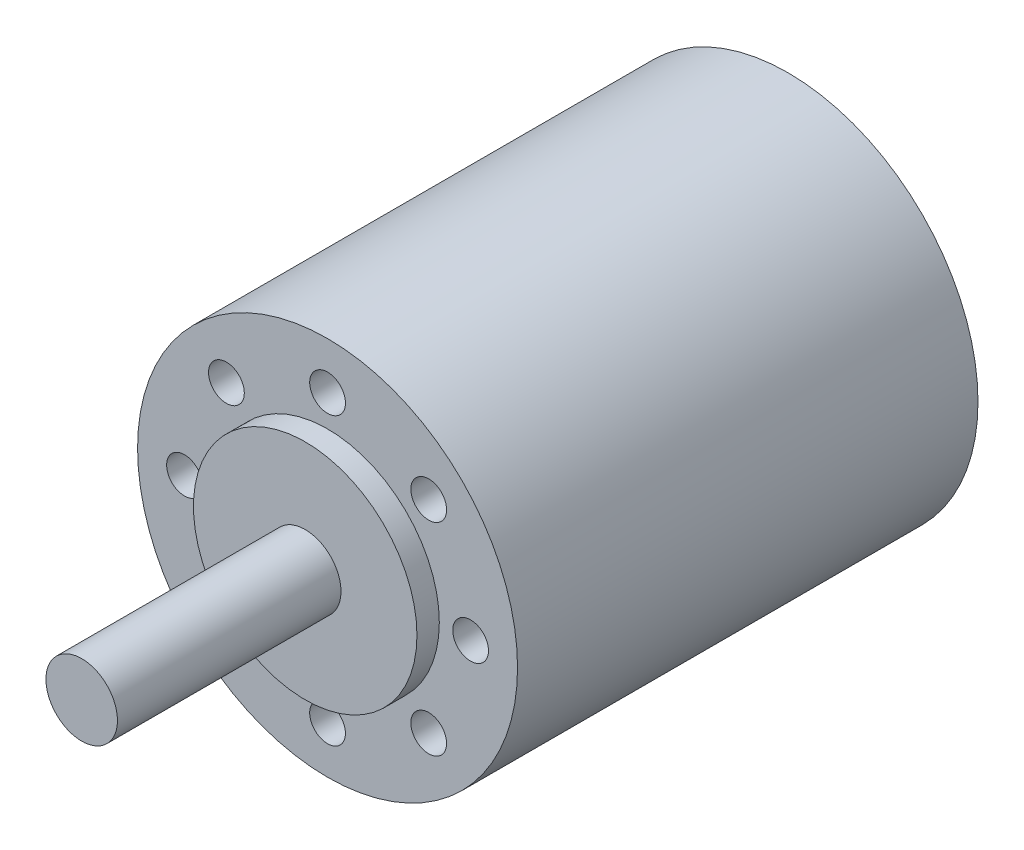
ISO-10303-21;
HEADER;
FILE_DESCRIPTION(('STEP AP214'),'2;1');
FILE_NAME('part.step','',(''),(''),'','','');
FILE_SCHEMA(('AUTOMOTIVE_DESIGN { 1 0 10303 214 1 1 1 1 }'));
ENDSEC;
DATA;
#1=APPLICATION_CONTEXT('core data for automotive mechanical design processes');
#2=APPLICATION_PROTOCOL_DEFINITION('international standard','automotive_design',2000,#1);
#3=PRODUCT_CONTEXT('',#1,'mechanical');
#4=PRODUCT('Part','Part','',(#3));
#5=PRODUCT_RELATED_PRODUCT_CATEGORY('part','',(#4));
#6=PRODUCT_DEFINITION_FORMATION('','',#4);
#7=PRODUCT_DEFINITION_CONTEXT('part definition',#1,'design');
#8=PRODUCT_DEFINITION('design','',#6,#7);
#9=PRODUCT_DEFINITION_SHAPE('','',#8);
#10=(LENGTH_UNIT() NAMED_UNIT(*) SI_UNIT(.MILLI.,.METRE.));
#11=(NAMED_UNIT(*) PLANE_ANGLE_UNIT() SI_UNIT($,.RADIAN.));
#12=(NAMED_UNIT(*) SI_UNIT($,.STERADIAN.) SOLID_ANGLE_UNIT());
#13=UNCERTAINTY_MEASURE_WITH_UNIT(LENGTH_MEASURE(1.E-05),#10,'distance_accuracy_value','');
#14=(GEOMETRIC_REPRESENTATION_CONTEXT(3) GLOBAL_UNCERTAINTY_ASSIGNED_CONTEXT((#13)) GLOBAL_UNIT_ASSIGNED_CONTEXT((#10,
#11,#12)) REPRESENTATION_CONTEXT('',''));
#15=CARTESIAN_POINT('',(0.,0.,0.));
#16=DIRECTION('',(0.,0.,1.));
#17=DIRECTION('',(1.,0.,0.));
#18=AXIS2_PLACEMENT_3D('',#15,#16,#17);
#19=CARTESIAN_POINT('',(0.,0.,79.));
#20=DIRECTION('',(0.,0.,-1.));
#21=DIRECTION('',(-1.,0.,0.));
#22=AXIS2_PLACEMENT_3D('',#19,#20,#21);
#23=CYLINDRICAL_SURFACE('',#22,4.);
#24=CARTESIAN_POINT('',(0.,0.,79.));
#25=DIRECTION('',(0.,0.,1.));
#26=DIRECTION('',(1.,0.,0.));
#27=AXIS2_PLACEMENT_3D('',#24,#25,#26);
#28=CIRCLE('',#27,4.);
#29=CARTESIAN_POINT('',(4.,0.,79.));
#30=VERTEX_POINT('',#29);
#31=EDGE_CURVE('E102',#30,#30,#28,.T.);
#32=ORIENTED_EDGE('',*,*,#31,.F.);
#33=EDGE_LOOP('',(#32));
#34=FACE_BOUND('',#33,.T.);
#35=CARTESIAN_POINT('',(0.,0.,54.));
#36=DIRECTION('',(0.,0.,1.));
#37=DIRECTION('',(1.,0.,0.));
#38=AXIS2_PLACEMENT_3D('',#35,#36,#37);
#39=CIRCLE('',#38,4.);
#40=CARTESIAN_POINT('',(4.,0.,54.));
#41=VERTEX_POINT('',#40);
#42=EDGE_CURVE('E98',#41,#41,#39,.T.);
#43=ORIENTED_EDGE('',*,*,#42,.T.);
#44=EDGE_LOOP('',(#43));
#45=FACE_BOUND('',#44,.T.);
#46=CARTESIAN_POINT('',(1.65,-3.64383040220041,74.85));
#47=CARTESIAN_POINT('',(1.65000206433639,-3.64382427223816,74.8942706908813));
#48=CARTESIAN_POINT('',(1.64821712430192,-3.6446382153464,74.9385178336697));
#49=CARTESIAN_POINT('',(1.6411118195852,-3.64784525107134,75.0266521100613));
#50=CARTESIAN_POINT('',(1.63579288731443,-3.65023770387761,75.0705393822355));
#51=CARTESIAN_POINT('',(1.61466141236794,-3.65966091653839,75.2008106570508));
#52=CARTESIAN_POINT('',(1.59367328092335,-3.66893875734012,75.2862524916208));
#53=CARTESIAN_POINT('',(1.53875289929766,-3.69230476939532,75.4519701218911));
#54=CARTESIAN_POINT('',(1.50483546902392,-3.70638743130195,75.5322517097382));
#55=CARTESIAN_POINT('',(1.42512375866127,-3.73776053310641,75.6860825522616));
#56=CARTESIAN_POINT('',(1.37931737135879,-3.7550542378556,75.7596248400126));
#57=CARTESIAN_POINT('',(1.27419396167584,-3.79205684258999,75.9022365177713));
#58=CARTESIAN_POINT('',(1.21427503360367,-3.8118461051715,75.9708412970611));
#59=CARTESIAN_POINT('',(1.08389882447046,-3.85094691899411,76.0973641246268));
#60=CARTESIAN_POINT('',(1.01343931626553,-3.87025836826954,76.1552799086091));
#61=CARTESIAN_POINT('',(0.860301746378244,-3.90721579087848,76.2611716281489));
#62=CARTESIAN_POINT('',(0.77723195798585,-3.92475625629673,76.3086212114796));
#63=CARTESIAN_POINT('',(0.603435885624749,-3.95520290122613,76.3886702849903));
#64=CARTESIAN_POINT('',(0.512712997089997,-3.96811112269761,76.4212763201281));
#65=CARTESIAN_POINT('',(0.331105971792477,-3.98726394919442,76.4690205047651));
#66=CARTESIAN_POINT('',(0.240467265722078,-3.99381552567137,76.4849665630012));
#67=CARTESIAN_POINT('',(0.0575780247902665,-4.00063060987568,76.5015466365377));
#68=CARTESIAN_POINT('',(-0.0346718857325417,-4.00089650147031,76.5021864567818));
#69=CARTESIAN_POINT('',(-0.21229812834418,-3.99529221808418,76.4885634484623));
#70=CARTESIAN_POINT('',(-0.297756148755553,-3.98978723766402,76.4751875881559));
#71=CARTESIAN_POINT('',(-0.465087267686629,-3.97375907807744,76.4354307202523));
#72=CARTESIAN_POINT('',(-0.546960163966662,-3.96323561621166,76.4090489800096));
#73=CARTESIAN_POINT('',(-0.706295192028344,-3.9379891427427,76.3437125252993));
#74=CARTESIAN_POINT('',(-0.783671178118834,-3.92320462469105,76.3045724793958));
#75=CARTESIAN_POINT('',(-0.930959778420699,-3.89088781720815,76.2150091716972));
#76=CARTESIAN_POINT('',(-1.00086968316415,-3.87335453589918,76.1645818341177));
#77=CARTESIAN_POINT('',(-1.1363810041566,-3.83587252151576,76.0498156521506));
#78=CARTESIAN_POINT('',(-1.2013494204994,-3.81584059981502,75.9847555706299));
#79=CARTESIAN_POINT('',(-1.31973191273581,-3.7765337949175,75.8445985366616));
#80=CARTESIAN_POINT('',(-1.37314028666975,-3.75725928913281,75.7694966605365));
#81=CARTESIAN_POINT('',(-1.46848052937885,-3.72105564032079,75.6083590936314));
#82=CARTESIAN_POINT('',(-1.50998766719896,-3.70422195724006,75.5220492796972));
#83=CARTESIAN_POINT('',(-1.5775761646494,-3.67595077182687,75.3428325618214));
#84=CARTESIAN_POINT('',(-1.60368564432379,-3.66450344042441,75.2499380331186));
#85=CARTESIAN_POINT('',(-1.63096830906829,-3.65240230423684,75.1050743611052));
#86=CARTESIAN_POINT('',(-1.63809379472864,-3.64920427375266,75.0543707739906));
#87=CARTESIAN_POINT('',(-1.6476112063093,-3.64491271596401,74.952455960762));
#88=CARTESIAN_POINT('',(-1.65000514883717,-3.64381829209725,74.9012449602674));
#89=CARTESIAN_POINT('',(-1.65,-3.64383040220041,74.85));
#90=B_SPLINE_CURVE_WITH_KNOTS('',3,(#46,#47,#48,#49,#50,#51,#52,#53,#54,#55,#56,#57,#58,#59,#60,
#61,#62,#63,#64,#65,#66,#67,#68,#69,#70,#71,#72,#73,#74,#75,#76,#77,#78,#79,#80,#81,#82,#83,#84,
#85,#86,#87,#88,#89),.UNSPECIFIED.,.F.,.F.,(4,2,2,2,2,2,2,2,2,2,2,2,2,2,2,2,2,2,2,2,2,4),(0.,
0.132723146684773,0.265392530298188,0.529404650826572,0.793115059154681,1.05709508000741,
1.33551265841408,1.61398914762986,1.90428773743341,2.19445820175801,2.46979190227511,
2.7450211798782,3.00382742831126,3.26264825744989,3.52541014405217,3.78826706615835,
4.06931517475004,4.35050159523976,4.64073866578628,4.93044403483361,5.08411233604002,
5.23771512890575),.UNSPECIFIED.);
#91=CARTESIAN_POINT('',(1.65,-3.64383040220041,74.85));
#92=VERTEX_POINT('',#91);
#93=CARTESIAN_POINT('',(-1.65,-3.64383040220041,74.85));
#94=VERTEX_POINT('',#93);
#95=EDGE_CURVE('E152',#92,#94,#90,.T.);
#96=ORIENTED_EDGE('',*,*,#95,.F.);
#97=DIRECTION('',(0.,0.,-1.));
#98=VECTOR('',#97,1.);
#99=CARTESIAN_POINT('',(1.65,-3.64383040220041,79.));
#100=LINE('',#99,#98);
#101=CARTESIAN_POINT('',(1.65,-3.64383040220041,58.15));
#102=VERTEX_POINT('',#101);
#103=EDGE_CURVE('E11',#102,#92,#100,.F.);
#104=ORIENTED_EDGE('',*,*,#103,.F.);
#105=CARTESIAN_POINT('',(-1.65,-3.64383040220041,58.15));
#106=CARTESIAN_POINT('',(-1.6500020643364,-3.64382427223816,58.1057293091187));
#107=CARTESIAN_POINT('',(-1.64821712430193,-3.6446382153464,58.0614821663303));
#108=CARTESIAN_POINT('',(-1.6411118195852,-3.64784525107134,57.9733478899387));
#109=CARTESIAN_POINT('',(-1.63579288731443,-3.65023770387761,57.9294606177645));
#110=CARTESIAN_POINT('',(-1.61466141236794,-3.65966091653839,57.7991893429492));
#111=CARTESIAN_POINT('',(-1.59367328092334,-3.66893875734012,57.7137475083792));
#112=CARTESIAN_POINT('',(-1.53875289929766,-3.69230476939532,57.5480298781089));
#113=CARTESIAN_POINT('',(-1.50483546902391,-3.70638743130195,57.4677482902618));
#114=CARTESIAN_POINT('',(-1.42512375866126,-3.73776053310642,57.3139174477384));
#115=CARTESIAN_POINT('',(-1.37931737135879,-3.7550542378556,57.2403751599874));
#116=CARTESIAN_POINT('',(-1.27419396167583,-3.79205684259,57.0977634822287));
#117=CARTESIAN_POINT('',(-1.21427503360365,-3.8118461051715,57.0291587029389));
#118=CARTESIAN_POINT('',(-1.08389882447045,-3.85094691899411,56.9026358753732));
#119=CARTESIAN_POINT('',(-1.01343931626552,-3.87025836826955,56.8447200913909));
#120=CARTESIAN_POINT('',(-0.860301746378229,-3.90721579087848,56.7388283718511));
#121=CARTESIAN_POINT('',(-0.777231957985836,-3.92475625629673,56.6913787885203));
#122=CARTESIAN_POINT('',(-0.603435885624738,-3.95520290122613,56.6113297150097));
#123=CARTESIAN_POINT('',(-0.512712997089989,-3.96811112269761,56.5787236798719));
#124=CARTESIAN_POINT('',(-0.33110597179247,-3.98726394919442,56.5309794952349));
#125=CARTESIAN_POINT('',(-0.240467265722071,-3.99381552567137,56.5150334369989));
#126=CARTESIAN_POINT('',(-0.0575780247902591,-4.00063060987568,56.4984533634623));
#127=CARTESIAN_POINT('',(0.0346718857325496,-4.00089650147031,56.4978135432182));
#128=CARTESIAN_POINT('',(0.212298128344189,-3.99529221808418,56.5114365515377));
#129=CARTESIAN_POINT('',(0.297756148755563,-3.98978723766402,56.5248124118441));
#130=CARTESIAN_POINT('',(0.465087267686639,-3.97375907807743,56.5645692797477));
#131=CARTESIAN_POINT('',(0.546960163966672,-3.96323561621166,56.5909510199904));
#132=CARTESIAN_POINT('',(0.706295192028356,-3.9379891427427,56.6562874747007));
#133=CARTESIAN_POINT('',(0.783671178118848,-3.92320462469105,56.6954275206042));
#134=CARTESIAN_POINT('',(0.930959778420711,-3.89088781720814,56.7849908283028));
#135=CARTESIAN_POINT('',(1.00086968316416,-3.87335453589918,56.8354181658823));
#136=CARTESIAN_POINT('',(1.13638100415661,-3.83587252151576,56.9501843478494));
#137=CARTESIAN_POINT('',(1.20134942049941,-3.81584059981501,57.0152444293701));
#138=CARTESIAN_POINT('',(1.31973191273582,-3.7765337949175,57.1554014633384));
#139=CARTESIAN_POINT('',(1.37314028666976,-3.75725928913281,57.2305033394635));
#140=CARTESIAN_POINT('',(1.46848052937886,-3.72105564032079,57.3916409063686));
#141=CARTESIAN_POINT('',(1.50998766719896,-3.70422195724006,57.4779507203028));
#142=CARTESIAN_POINT('',(1.5775761646494,-3.67595077182687,57.6571674381786));
#143=CARTESIAN_POINT('',(1.60368564432379,-3.66450344042441,57.7500619668814));
#144=CARTESIAN_POINT('',(1.63096830906829,-3.65240230423684,57.8949256388948));
#145=CARTESIAN_POINT('',(1.63809379472864,-3.64920427375266,57.9456292260095));
#146=CARTESIAN_POINT('',(1.6476112063093,-3.64491271596401,58.047544039238));
#147=CARTESIAN_POINT('',(1.65000514883717,-3.64381829209725,58.0987550397326));
#148=CARTESIAN_POINT('',(1.65,-3.64383040220041,58.15));
#149=B_SPLINE_CURVE_WITH_KNOTS('',3,(#105,#106,#107,#108,#109,#110,#111,#112,#113,#114,#115,
#116,#117,#118,#119,#120,#121,#122,#123,#124,#125,#126,#127,#128,#129,#130,#131,#132,#133,#134,
#135,#136,#137,#138,#139,#140,#141,#142,#143,#144,#145,#146,#147,#148),.UNSPECIFIED.,.F.,.F.,(4,
2,2,2,2,2,2,2,2,2,2,2,2,2,2,2,2,2,2,2,2,4),(0.,0.132723146684773,0.265392530298182,
0.529404650826579,0.793115059154697,1.05709508000743,1.3355126584141,1.61398914762988,
1.90428773743342,2.19445820175801,2.46979190227512,2.74502117987821,3.00382742831127,
3.2626482574499,3.52541014405219,3.78826706615836,4.06931517475006,4.35050159523977,
4.64073866578629,4.93044403483361,5.08411233604003,5.23771512890575),.UNSPECIFIED.);
#150=CARTESIAN_POINT('',(-1.65,-3.64383040220041,58.15));
#151=VERTEX_POINT('',#150);
#152=EDGE_CURVE('E46',#151,#102,#149,.T.);
#153=ORIENTED_EDGE('',*,*,#152,.F.);
#154=DIRECTION('',(0.,0.,-1.));
#155=VECTOR('',#154,1.);
#156=CARTESIAN_POINT('',(-1.65,-3.64383040220041,79.));
#157=LINE('',#156,#155);
#158=EDGE_CURVE('E97',#94,#151,#157,.T.);
#159=ORIENTED_EDGE('',*,*,#158,.F.);
#160=EDGE_LOOP('',(#96,#104,#153,#159));
#161=FACE_BOUND('',#160,.T.);
#162=ADVANCED_FACE('F38',(#34,#45,#161),#23,.T.);
#163=CARTESIAN_POINT('',(0.,0.,54.));
#164=DIRECTION('',(0.,0.,1.));
#165=DIRECTION('',(1.,0.,0.));
#166=AXIS2_PLACEMENT_3D('',#163,#164,#165);
#167=PLANE('',#166);
#168=CARTESIAN_POINT('',(0.,0.,54.));
#169=DIRECTION('',(0.,0.,1.));
#170=DIRECTION('',(1.,0.,0.));
#171=AXIS2_PLACEMENT_3D('',#168,#169,#170);
#172=CIRCLE('',#171,12.5);
#173=CARTESIAN_POINT('',(12.5,0.,54.));
#174=VERTEX_POINT('',#173);
#175=EDGE_CURVE('E111',#174,#174,#172,.T.);
#176=ORIENTED_EDGE('',*,*,#175,.T.);
#177=EDGE_LOOP('',(#176));
#178=FACE_BOUND('',#177,.T.);
#179=ORIENTED_EDGE('',*,*,#42,.F.);
#180=EDGE_LOOP('',(#179));
#181=FACE_BOUND('',#180,.T.);
#182=ADVANCED_FACE('F246',(#178,#181),#167,.T.);
#183=CARTESIAN_POINT('',(0.,0.,51.5));
#184=DIRECTION('',(0.,0.,1.));
#185=DIRECTION('',(1.,0.,0.));
#186=AXIS2_PLACEMENT_3D('',#183,#184,#185);
#187=PLANE('',#186);
#188=CARTESIAN_POINT('',(-11.3137084989848,11.3137084989847,51.5));
#189=DIRECTION('',(0.,0.,1.));
#190=DIRECTION('',(1.,0.,0.));
#191=AXIS2_PLACEMENT_3D('',#188,#189,#190);
#192=CIRCLE('',#191,2.);
#193=CARTESIAN_POINT('',(-9.31370849898478,11.3137084989847,51.5));
#194=VERTEX_POINT('',#193);
#195=EDGE_CURVE('E227',#194,#194,#192,.T.);
#196=ORIENTED_EDGE('',*,*,#195,.F.);
#197=EDGE_LOOP('',(#196));
#198=FACE_BOUND('',#197,.T.);
#199=CARTESIAN_POINT('',(-11.3137084989847,-11.3137084989848,51.5));
#200=DIRECTION('',(0.,0.,1.));
#201=DIRECTION('',(1.,0.,0.));
#202=AXIS2_PLACEMENT_3D('',#199,#200,#201);
#203=CIRCLE('',#202,2.);
#204=CARTESIAN_POINT('',(-9.31370849898474,-11.3137084989848,51.5));
#205=VERTEX_POINT('',#204);
#206=EDGE_CURVE('E221',#205,#205,#203,.T.);
#207=ORIENTED_EDGE('',*,*,#206,.F.);
#208=EDGE_LOOP('',(#207));
#209=FACE_BOUND('',#208,.T.);
#210=CARTESIAN_POINT('',(11.3137084989848,-11.3137084989847,51.5));
#211=DIRECTION('',(0.,0.,1.));
#212=DIRECTION('',(1.,0.,0.));
#213=AXIS2_PLACEMENT_3D('',#210,#211,#212);
#214=CIRCLE('',#213,2.);
#215=CARTESIAN_POINT('',(13.3137084989848,-11.3137084989847,51.5));
#216=VERTEX_POINT('',#215);
#217=EDGE_CURVE('E215',#216,#216,#214,.T.);
#218=ORIENTED_EDGE('',*,*,#217,.F.);
#219=EDGE_LOOP('',(#218));
#220=FACE_BOUND('',#219,.T.);
#221=CARTESIAN_POINT('',(11.3137084989848,11.3137084989847,51.5));
#222=DIRECTION('',(0.,0.,1.));
#223=DIRECTION('',(1.,0.,0.));
#224=AXIS2_PLACEMENT_3D('',#221,#222,#223);
#225=CIRCLE('',#224,2.);
#226=CARTESIAN_POINT('',(13.3137084989848,11.3137084989847,51.5));
#227=VERTEX_POINT('',#226);
#228=EDGE_CURVE('E209',#227,#227,#225,.T.);
#229=ORIENTED_EDGE('',*,*,#228,.F.);
#230=EDGE_LOOP('',(#229));
#231=FACE_BOUND('',#230,.T.);
#232=CARTESIAN_POINT('',(0.,16.,51.5));
#233=DIRECTION('',(0.,0.,1.));
#234=DIRECTION('',(1.,0.,0.));
#235=AXIS2_PLACEMENT_3D('',#232,#233,#234);
#236=CIRCLE('',#235,2.);
#237=CARTESIAN_POINT('',(2.,16.,51.5));
#238=VERTEX_POINT('',#237);
#239=EDGE_CURVE('E203',#238,#238,#236,.T.);
#240=ORIENTED_EDGE('',*,*,#239,.F.);
#241=EDGE_LOOP('',(#240));
#242=FACE_BOUND('',#241,.T.);
#243=CARTESIAN_POINT('',(-16.,0.,51.5));
#244=DIRECTION('',(0.,0.,1.));
#245=DIRECTION('',(1.,0.,0.));
#246=AXIS2_PLACEMENT_3D('',#243,#244,#245);
#247=CIRCLE('',#246,2.);
#248=CARTESIAN_POINT('',(-14.,0.,51.5));
#249=VERTEX_POINT('',#248);
#250=EDGE_CURVE('E197',#249,#249,#247,.T.);
#251=ORIENTED_EDGE('',*,*,#250,.F.);
#252=EDGE_LOOP('',(#251));
#253=FACE_BOUND('',#252,.T.);
#254=CARTESIAN_POINT('',(0.,-16.,51.5));
#255=DIRECTION('',(0.,0.,1.));
#256=DIRECTION('',(1.,0.,0.));
#257=AXIS2_PLACEMENT_3D('',#254,#255,#256);
#258=CIRCLE('',#257,2.);
#259=CARTESIAN_POINT('',(2.,-16.,51.5));
#260=VERTEX_POINT('',#259);
#261=EDGE_CURVE('E191',#260,#260,#258,.T.);
#262=ORIENTED_EDGE('',*,*,#261,.F.);
#263=EDGE_LOOP('',(#262));
#264=FACE_BOUND('',#263,.T.);
#265=CARTESIAN_POINT('',(16.,0.,51.5));
#266=DIRECTION('',(0.,0.,1.));
#267=DIRECTION('',(1.,0.,0.));
#268=AXIS2_PLACEMENT_3D('',#265,#266,#267);
#269=CIRCLE('',#268,2.);
#270=CARTESIAN_POINT('',(18.,0.,51.5));
#271=VERTEX_POINT('',#270);
#272=EDGE_CURVE('E185',#271,#271,#269,.T.);
#273=ORIENTED_EDGE('',*,*,#272,.F.);
#274=EDGE_LOOP('',(#273));
#275=FACE_BOUND('',#274,.T.);
#276=CARTESIAN_POINT('',(0.,0.,51.5));
#277=DIRECTION('',(0.,0.,1.));
#278=DIRECTION('',(1.,0.,0.));
#279=AXIS2_PLACEMENT_3D('',#276,#277,#278);
#280=CIRCLE('',#279,21.25);
#281=CARTESIAN_POINT('',(21.25,0.,51.5));
#282=VERTEX_POINT('',#281);
#283=EDGE_CURVE('E141',#282,#282,#280,.T.);
#284=ORIENTED_EDGE('',*,*,#283,.T.);
#285=EDGE_LOOP('',(#284));
#286=FACE_BOUND('',#285,.T.);
#287=CARTESIAN_POINT('',(0.,0.,51.5));
#288=DIRECTION('',(0.,0.,1.));
#289=DIRECTION('',(1.,0.,0.));
#290=AXIS2_PLACEMENT_3D('',#287,#288,#289);
#291=CIRCLE('',#290,12.5);
#292=CARTESIAN_POINT('',(12.5,0.,51.5));
#293=VERTEX_POINT('',#292);
#294=EDGE_CURVE('E109',#293,#293,#291,.T.);
#295=ORIENTED_EDGE('',*,*,#294,.F.);
#296=EDGE_LOOP('',(#295));
#297=FACE_BOUND('',#296,.T.);
#298=ADVANCED_FACE('F242',(#198,#209,#220,#231,#242,#253,#264,#275,#286,#297),#187,.T.);
#299=CARTESIAN_POINT('',(0.,0.,0.));
#300=DIRECTION('',(0.,0.,1.));
#301=DIRECTION('',(1.,0.,0.));
#302=AXIS2_PLACEMENT_3D('',#299,#300,#301);
#303=PLANE('',#302);
#304=CARTESIAN_POINT('',(0.,0.,0.));
#305=DIRECTION('',(0.,0.,-1.));
#306=DIRECTION('',(-1.,0.,0.));
#307=AXIS2_PLACEMENT_3D('',#304,#305,#306);
#308=CIRCLE('',#307,8.75);
#309=CARTESIAN_POINT('',(-8.75,0.,0.));
#310=VERTEX_POINT('',#309);
#311=EDGE_CURVE('E126',#310,#310,#308,.T.);
#312=ORIENTED_EDGE('',*,*,#311,.F.);
#313=EDGE_LOOP('',(#312));
#314=FACE_BOUND('',#313,.T.);
#315=CARTESIAN_POINT('',(0.,12.5,0.));
#316=DIRECTION('',(0.,0.,1.));
#317=DIRECTION('',(1.,0.,0.));
#318=AXIS2_PLACEMENT_3D('',#315,#316,#317);
#319=CIRCLE('',#318,1.5);
#320=CARTESIAN_POINT('',(1.5,12.5,0.));
#321=VERTEX_POINT('',#320);
#322=EDGE_CURVE('E144',#321,#321,#319,.F.);
#323=ORIENTED_EDGE('',*,*,#322,.F.);
#324=EDGE_LOOP('',(#323));
#325=FACE_BOUND('',#324,.T.);
#326=CARTESIAN_POINT('',(0.,0.,0.));
#327=DIRECTION('',(0.,0.,1.));
#328=DIRECTION('',(1.,0.,0.));
#329=AXIS2_PLACEMENT_3D('',#326,#327,#328);
#330=CIRCLE('',#329,21.25);
#331=CARTESIAN_POINT('',(21.25,0.,0.));
#332=VERTEX_POINT('',#331);
#333=EDGE_CURVE('E140',#332,#332,#330,.T.);
#334=ORIENTED_EDGE('',*,*,#333,.F.);
#335=EDGE_LOOP('',(#334));
#336=FACE_BOUND('',#335,.T.);
#337=CARTESIAN_POINT('',(0.,-12.5,0.));
#338=DIRECTION('',(0.,0.,1.));
#339=DIRECTION('',(1.,0.,0.));
#340=AXIS2_PLACEMENT_3D('',#337,#338,#339);
#341=CIRCLE('',#340,1.5);
#342=CARTESIAN_POINT('',(1.5,-12.5,0.));
#343=VERTEX_POINT('',#342);
#344=EDGE_CURVE('E149',#343,#343,#341,.F.);
#345=ORIENTED_EDGE('',*,*,#344,.F.);
#346=EDGE_LOOP('',(#345));
#347=FACE_BOUND('',#346,.T.);
#348=ADVANCED_FACE('F245',(#314,#325,#336,#347),#303,.F.);
#349=CARTESIAN_POINT('',(0.,0.,51.5));
#350=DIRECTION('',(0.,0.,-1.));
#351=DIRECTION('',(-1.,0.,0.));
#352=AXIS2_PLACEMENT_3D('',#349,#350,#351);
#353=CYLINDRICAL_SURFACE('',#352,21.25);
#354=ORIENTED_EDGE('',*,*,#283,.F.);
#355=EDGE_LOOP('',(#354));
#356=FACE_BOUND('',#355,.T.);
#357=ORIENTED_EDGE('',*,*,#333,.T.);
#358=EDGE_LOOP('',(#357));
#359=FACE_BOUND('',#358,.T.);
#360=ADVANCED_FACE('F40',(#356,#359),#353,.T.);
#361=CARTESIAN_POINT('',(0.,12.5,-4.));
#362=DIRECTION('',(0.,0.,1.));
#363=DIRECTION('',(1.,0.,0.));
#364=AXIS2_PLACEMENT_3D('',#361,#362,#363);
#365=CYLINDRICAL_SURFACE('',#364,1.5);
#366=CARTESIAN_POINT('',(0.,12.5,-4.));
#367=DIRECTION('',(0.,0.,-1.));
#368=DIRECTION('',(-1.,0.,0.));
#369=AXIS2_PLACEMENT_3D('',#366,#367,#368);
#370=CIRCLE('',#369,1.5);
#371=CARTESIAN_POINT('',(-1.5,12.5,-4.));
#372=VERTEX_POINT('',#371);
#373=EDGE_CURVE('E137',#372,#372,#370,.T.);
#374=ORIENTED_EDGE('',*,*,#373,.F.);
#375=EDGE_LOOP('',(#374));
#376=FACE_BOUND('',#375,.T.);
#377=ORIENTED_EDGE('',*,*,#322,.T.);
#378=EDGE_LOOP('',(#377));
#379=FACE_BOUND('',#378,.T.);
#380=ADVANCED_FACE('F312',(#376,#379),#365,.T.);
#381=CARTESIAN_POINT('',(0.,12.5,-4.));
#382=DIRECTION('',(0.,0.,-1.));
#383=DIRECTION('',(-1.,0.,0.));
#384=AXIS2_PLACEMENT_3D('',#381,#382,#383);
#385=PLANE('',#384);
#386=ORIENTED_EDGE('',*,*,#373,.T.);
#387=EDGE_LOOP('',(#386));
#388=FACE_BOUND('',#387,.T.);
#389=ADVANCED_FACE('F319',(#388),#385,.T.);
#390=CARTESIAN_POINT('',(0.,-12.5,-4.));
#391=DIRECTION('',(0.,0.,1.));
#392=DIRECTION('',(1.,0.,0.));
#393=AXIS2_PLACEMENT_3D('',#390,#391,#392);
#394=CYLINDRICAL_SURFACE('',#393,1.5);
#395=CARTESIAN_POINT('',(0.,-12.5,-4.));
#396=DIRECTION('',(0.,0.,-1.));
#397=DIRECTION('',(-1.,0.,0.));
#398=AXIS2_PLACEMENT_3D('',#395,#396,#397);
#399=CIRCLE('',#398,1.5);
#400=CARTESIAN_POINT('',(-1.5,-12.5,-4.));
#401=VERTEX_POINT('',#400);
#402=EDGE_CURVE('E132',#401,#401,#399,.T.);
#403=ORIENTED_EDGE('',*,*,#402,.F.);
#404=EDGE_LOOP('',(#403));
#405=FACE_BOUND('',#404,.T.);
#406=ORIENTED_EDGE('',*,*,#344,.T.);
#407=EDGE_LOOP('',(#406));
#408=FACE_BOUND('',#407,.T.);
#409=ADVANCED_FACE('F327',(#405,#408),#394,.T.);
#410=CARTESIAN_POINT('',(0.,-12.5,-4.));
#411=DIRECTION('',(0.,0.,-1.));
#412=DIRECTION('',(-1.,0.,0.));
#413=AXIS2_PLACEMENT_3D('',#410,#411,#412);
#414=PLANE('',#413);
#415=ORIENTED_EDGE('',*,*,#402,.T.);
#416=EDGE_LOOP('',(#415));
#417=FACE_BOUND('',#416,.T.);
#418=ADVANCED_FACE('F335',(#417),#414,.T.);
#419=CARTESIAN_POINT('',(0.,0.,1.5));
#420=DIRECTION('',(0.,0.,-1.));
#421=DIRECTION('',(-1.,0.,0.));
#422=AXIS2_PLACEMENT_3D('',#419,#420,#421);
#423=CYLINDRICAL_SURFACE('',#422,8.75);
#424=CARTESIAN_POINT('',(0.,0.,1.5));
#425=DIRECTION('',(0.,0.,-1.));
#426=DIRECTION('',(-1.,0.,0.));
#427=AXIS2_PLACEMENT_3D('',#424,#425,#426);
#428=CIRCLE('',#427,8.75);
#429=CARTESIAN_POINT('',(-8.75,0.,1.5));
#430=VERTEX_POINT('',#429);
#431=EDGE_CURVE('E129',#430,#430,#428,.T.);
#432=ORIENTED_EDGE('',*,*,#431,.F.);
#433=EDGE_LOOP('',(#432));
#434=FACE_BOUND('',#433,.T.);
#435=ORIENTED_EDGE('',*,*,#311,.T.);
#436=EDGE_LOOP('',(#435));
#437=FACE_BOUND('',#436,.T.);
#438=ADVANCED_FACE('F342',(#434,#437),#423,.F.);
#439=CARTESIAN_POINT('',(0.,0.,1.5));
#440=DIRECTION('',(0.,0.,-1.));
#441=DIRECTION('',(-1.,0.,0.));
#442=AXIS2_PLACEMENT_3D('',#439,#440,#441);
#443=PLANE('',#442);
#444=CARTESIAN_POINT('',(0.,0.,1.5));
#445=DIRECTION('',(0.,0.,-1.));
#446=DIRECTION('',(-1.,0.,0.));
#447=AXIS2_PLACEMENT_3D('',#444,#445,#446);
#448=CIRCLE('',#447,2.5);
#449=CARTESIAN_POINT('',(-2.5,0.,1.5));
#450=VERTEX_POINT('',#449);
#451=EDGE_CURVE('E120',#450,#450,#448,.T.);
#452=ORIENTED_EDGE('',*,*,#451,.F.);
#453=EDGE_LOOP('',(#452));
#454=FACE_BOUND('',#453,.T.);
#455=ORIENTED_EDGE('',*,*,#431,.T.);
#456=EDGE_LOOP('',(#455));
#457=FACE_BOUND('',#456,.T.);
#458=ADVANCED_FACE('F349',(#454,#457),#443,.T.);
#459=CARTESIAN_POINT('',(0.,0.,7.8));
#460=DIRECTION('',(0.,0.,-1.));
#461=DIRECTION('',(-1.,0.,0.));
#462=AXIS2_PLACEMENT_3D('',#459,#460,#461);
#463=CYLINDRICAL_SURFACE('',#462,2.5);
#464=CARTESIAN_POINT('',(0.,0.,7.8));
#465=DIRECTION('',(0.,0.,-1.));
#466=DIRECTION('',(-1.,0.,0.));
#467=AXIS2_PLACEMENT_3D('',#464,#465,#466);
#468=CIRCLE('',#467,2.5);
#469=CARTESIAN_POINT('',(-2.5,0.,7.8));
#470=VERTEX_POINT('',#469);
#471=EDGE_CURVE('E123',#470,#470,#468,.T.);
#472=ORIENTED_EDGE('',*,*,#471,.F.);
#473=EDGE_LOOP('',(#472));
#474=FACE_BOUND('',#473,.T.);
#475=ORIENTED_EDGE('',*,*,#451,.T.);
#476=EDGE_LOOP('',(#475));
#477=FACE_BOUND('',#476,.T.);
#478=ADVANCED_FACE('F357',(#474,#477),#463,.F.);
#479=CARTESIAN_POINT('',(0.,0.,7.8));
#480=DIRECTION('',(0.,0.,-1.));
#481=DIRECTION('',(-1.,0.,0.));
#482=AXIS2_PLACEMENT_3D('',#479,#480,#481);
#483=PLANE('',#482);
#484=CARTESIAN_POINT('',(0.,0.,7.8));
#485=DIRECTION('',(0.,0.,-1.));
#486=DIRECTION('',(-1.,0.,0.));
#487=AXIS2_PLACEMENT_3D('',#484,#485,#486);
#488=CIRCLE('',#487,2.);
#489=CARTESIAN_POINT('',(-2.,0.,7.8));
#490=VERTEX_POINT('',#489);
#491=EDGE_CURVE('E114',#490,#490,#488,.T.);
#492=ORIENTED_EDGE('',*,*,#491,.F.);
#493=EDGE_LOOP('',(#492));
#494=FACE_BOUND('',#493,.T.);
#495=ORIENTED_EDGE('',*,*,#471,.T.);
#496=EDGE_LOOP('',(#495));
#497=FACE_BOUND('',#496,.T.);
#498=ADVANCED_FACE('F365',(#494,#497),#483,.T.);
#499=CARTESIAN_POINT('',(0.,0.,14.8));
#500=DIRECTION('',(0.,0.,-1.));
#501=DIRECTION('',(-1.,0.,0.));
#502=AXIS2_PLACEMENT_3D('',#499,#500,#501);
#503=CYLINDRICAL_SURFACE('',#502,2.);
#504=CARTESIAN_POINT('',(0.,0.,14.8));
#505=DIRECTION('',(0.,0.,-1.));
#506=DIRECTION('',(-1.,0.,0.));
#507=AXIS2_PLACEMENT_3D('',#504,#505,#506);
#508=CIRCLE('',#507,2.);
#509=CARTESIAN_POINT('',(-2.,0.,14.8));
#510=VERTEX_POINT('',#509);
#511=EDGE_CURVE('E117',#510,#510,#508,.T.);
#512=ORIENTED_EDGE('',*,*,#511,.F.);
#513=EDGE_LOOP('',(#512));
#514=FACE_BOUND('',#513,.T.);
#515=ORIENTED_EDGE('',*,*,#491,.T.);
#516=EDGE_LOOP('',(#515));
#517=FACE_BOUND('',#516,.T.);
#518=ADVANCED_FACE('F276',(#514,#517),#503,.F.);
#519=CARTESIAN_POINT('',(0.,0.,14.8));
#520=DIRECTION('',(0.,0.,-1.));
#521=DIRECTION('',(-1.,0.,0.));
#522=AXIS2_PLACEMENT_3D('',#519,#520,#521);
#523=PLANE('',#522);
#524=ORIENTED_EDGE('',*,*,#511,.T.);
#525=EDGE_LOOP('',(#524));
#526=FACE_BOUND('',#525,.T.);
#527=ADVANCED_FACE('F268',(#526),#523,.T.);
#528=CARTESIAN_POINT('',(0.,0.,54.));
#529=DIRECTION('',(0.,0.,-1.));
#530=DIRECTION('',(-1.,0.,0.));
#531=AXIS2_PLACEMENT_3D('',#528,#529,#530);
#532=CYLINDRICAL_SURFACE('',#531,12.5);
#533=ORIENTED_EDGE('',*,*,#175,.F.);
#534=EDGE_LOOP('',(#533));
#535=FACE_BOUND('',#534,.T.);
#536=ORIENTED_EDGE('',*,*,#294,.T.);
#537=EDGE_LOOP('',(#536));
#538=FACE_BOUND('',#537,.T.);
#539=ADVANCED_FACE('F266',(#535,#538),#532,.T.);
#540=CARTESIAN_POINT('',(0.,0.,79.));
#541=DIRECTION('',(0.,0.,1.));
#542=DIRECTION('',(1.,0.,0.));
#543=AXIS2_PLACEMENT_3D('',#540,#541,#542);
#544=PLANE('',#543);
#545=ORIENTED_EDGE('',*,*,#31,.T.);
#546=EDGE_LOOP('',(#545));
#547=FACE_BOUND('',#546,.T.);
#548=ADVANCED_FACE('F174',(#547),#544,.T.);
#549=CARTESIAN_POINT('',(0.,-0.5,58.15));
#550=DIRECTION('',(0.,-1.,0.));
#551=DIRECTION('',(0.,0.,-1.));
#552=AXIS2_PLACEMENT_3D('',#549,#550,#551);
#553=CYLINDRICAL_SURFACE('',#552,1.65);
#554=DIRECTION('',(0.,-1.,0.));
#555=VECTOR('',#554,1.);
#556=CARTESIAN_POINT('',(-1.65,-0.5,58.15));
#557=LINE('',#556,#555);
#558=CARTESIAN_POINT('',(-1.65,-0.5,58.15));
#559=VERTEX_POINT('',#558);
#560=EDGE_CURVE('E93',#559,#151,#557,.T.);
#561=ORIENTED_EDGE('',*,*,#560,.T.);
#562=ORIENTED_EDGE('',*,*,#152,.T.);
#563=DIRECTION('',(0.,-1.,0.));
#564=VECTOR('',#563,1.);
#565=CARTESIAN_POINT('',(1.65,-0.5,58.15));
#566=LINE('',#565,#564);
#567=CARTESIAN_POINT('',(1.65,-0.5,58.15));
#568=VERTEX_POINT('',#567);
#569=EDGE_CURVE('E52',#568,#102,#566,.T.);
#570=ORIENTED_EDGE('',*,*,#569,.F.);
#571=CARTESIAN_POINT('',(0.,-0.5,58.15));
#572=DIRECTION('',(0.,1.,0.));
#573=DIRECTION('',(0.,0.,1.));
#574=AXIS2_PLACEMENT_3D('',#571,#572,#573);
#575=CIRCLE('',#574,1.65);
#576=EDGE_CURVE('E83',#568,#559,#575,.T.);
#577=ORIENTED_EDGE('',*,*,#576,.T.);
#578=EDGE_LOOP('',(#561,#562,#570,#577));
#579=FACE_BOUND('',#578,.T.);
#580=ADVANCED_FACE('F92',(#579),#553,.F.);
#581=CARTESIAN_POINT('',(-1.65,-0.5,74.85));
#582=DIRECTION('',(1.,0.,0.));
#583=DIRECTION('',(0.,0.,-1.));
#584=AXIS2_PLACEMENT_3D('',#581,#582,#583);
#585=PLANE('',#584);
#586=ORIENTED_EDGE('',*,*,#158,.T.);
#587=ORIENTED_EDGE('',*,*,#560,.F.);
#588=DIRECTION('',(0.,0.,1.));
#589=VECTOR('',#588,1.);
#590=CARTESIAN_POINT('',(-1.65,-0.5,74.85));
#591=LINE('',#590,#589);
#592=CARTESIAN_POINT('',(-1.65,-0.5,74.85));
#593=VERTEX_POINT('',#592);
#594=EDGE_CURVE('E79',#559,#593,#591,.T.);
#595=ORIENTED_EDGE('',*,*,#594,.T.);
#596=DIRECTION('',(0.,-1.,0.));
#597=VECTOR('',#596,1.);
#598=CARTESIAN_POINT('',(-1.65,-0.5,74.85));
#599=LINE('',#598,#597);
#600=EDGE_CURVE('E99',#593,#94,#599,.T.);
#601=ORIENTED_EDGE('',*,*,#600,.T.);
#602=EDGE_LOOP('',(#586,#587,#595,#601));
#603=FACE_BOUND('',#602,.T.);
#604=ADVANCED_FACE('F96',(#603),#585,.T.);
#605=CARTESIAN_POINT('',(0.,-0.5,74.85));
#606=DIRECTION('',(0.,-1.,0.));
#607=DIRECTION('',(0.,0.,-1.));
#608=AXIS2_PLACEMENT_3D('',#605,#606,#607);
#609=CYLINDRICAL_SURFACE('',#608,1.65);
#610=DIRECTION('',(0.,-1.,0.));
#611=VECTOR('',#610,1.);
#612=CARTESIAN_POINT('',(1.65,-0.5,74.85));
#613=LINE('',#612,#611);
#614=CARTESIAN_POINT('',(1.65,-0.5,74.85));
#615=VERTEX_POINT('',#614);
#616=EDGE_CURVE('E104',#615,#92,#613,.T.);
#617=ORIENTED_EDGE('',*,*,#616,.T.);
#618=ORIENTED_EDGE('',*,*,#95,.T.);
#619=ORIENTED_EDGE('',*,*,#600,.F.);
#620=CARTESIAN_POINT('',(0.,-0.5,74.85));
#621=DIRECTION('',(0.,1.,0.));
#622=DIRECTION('',(0.,0.,1.));
#623=AXIS2_PLACEMENT_3D('',#620,#621,#622);
#624=CIRCLE('',#623,1.65);
#625=EDGE_CURVE('E84',#593,#615,#624,.T.);
#626=ORIENTED_EDGE('',*,*,#625,.T.);
#627=EDGE_LOOP('',(#617,#618,#619,#626));
#628=FACE_BOUND('',#627,.T.);
#629=ADVANCED_FACE('F162',(#628),#609,.F.);
#630=CARTESIAN_POINT('',(1.65,-0.5,58.15));
#631=DIRECTION('',(-1.,0.,0.));
#632=DIRECTION('',(0.,0.,1.));
#633=AXIS2_PLACEMENT_3D('',#630,#631,#632);
#634=PLANE('',#633);
#635=ORIENTED_EDGE('',*,*,#103,.T.);
#636=ORIENTED_EDGE('',*,*,#616,.F.);
#637=DIRECTION('',(0.,0.,-1.));
#638=VECTOR('',#637,1.);
#639=CARTESIAN_POINT('',(1.65,-0.5,58.15));
#640=LINE('',#639,#638);
#641=EDGE_CURVE('E180',#615,#568,#640,.T.);
#642=ORIENTED_EDGE('',*,*,#641,.T.);
#643=ORIENTED_EDGE('',*,*,#569,.T.);
#644=EDGE_LOOP('',(#635,#636,#642,#643));
#645=FACE_BOUND('',#644,.T.);
#646=ADVANCED_FACE('F167',(#645),#634,.T.);
#647=CARTESIAN_POINT('',(0.,-0.5,58.15));
#648=DIRECTION('',(0.,1.,0.));
#649=DIRECTION('',(0.,0.,1.));
#650=AXIS2_PLACEMENT_3D('',#647,#648,#649);
#651=PLANE('',#650);
#652=ORIENTED_EDGE('',*,*,#576,.F.);
#653=ORIENTED_EDGE('',*,*,#641,.F.);
#654=ORIENTED_EDGE('',*,*,#625,.F.);
#655=ORIENTED_EDGE('',*,*,#594,.F.);
#656=EDGE_LOOP('',(#652,#653,#654,#655));
#657=FACE_BOUND('',#656,.T.);
#658=ADVANCED_FACE('F81',(#657),#651,.F.);
#659=CARTESIAN_POINT('',(16.,0.,44.5));
#660=DIRECTION('',(0.,0.,1.));
#661=DIRECTION('',(1.,0.,0.));
#662=AXIS2_PLACEMENT_3D('',#659,#660,#661);
#663=CYLINDRICAL_SURFACE('',#662,2.);
#664=CARTESIAN_POINT('',(16.,0.,44.5));
#665=DIRECTION('',(0.,0.,1.));
#666=DIRECTION('',(1.,0.,0.));
#667=AXIS2_PLACEMENT_3D('',#664,#665,#666);
#668=CIRCLE('',#667,2.);
#669=CARTESIAN_POINT('',(18.,0.,44.5));
#670=VERTEX_POINT('',#669);
#671=EDGE_CURVE('E94',#670,#670,#668,.T.);
#672=ORIENTED_EDGE('',*,*,#671,.F.);
#673=EDGE_LOOP('',(#672));
#674=FACE_BOUND('',#673,.T.);
#675=ORIENTED_EDGE('',*,*,#272,.T.);
#676=EDGE_LOOP('',(#675));
#677=FACE_BOUND('',#676,.T.);
#678=ADVANCED_FACE('F431',(#674,#677),#663,.F.);
#679=CARTESIAN_POINT('',(16.,0.,44.5));
#680=DIRECTION('',(0.,0.,1.));
#681=DIRECTION('',(1.,0.,0.));
#682=AXIS2_PLACEMENT_3D('',#679,#680,#681);
#683=PLANE('',#682);
#684=ORIENTED_EDGE('',*,*,#671,.T.);
#685=EDGE_LOOP('',(#684));
#686=FACE_BOUND('',#685,.T.);
#687=ADVANCED_FACE('F437',(#686),#683,.T.);
#688=CARTESIAN_POINT('',(0.,-16.,44.5));
#689=DIRECTION('',(0.,0.,1.));
#690=DIRECTION('',(1.,0.,0.));
#691=AXIS2_PLACEMENT_3D('',#688,#689,#690);
#692=CYLINDRICAL_SURFACE('',#691,2.);
#693=CARTESIAN_POINT('',(0.,-16.,44.5));
#694=DIRECTION('',(0.,0.,1.));
#695=DIRECTION('',(1.,0.,0.));
#696=AXIS2_PLACEMENT_3D('',#693,#694,#695);
#697=CIRCLE('',#696,2.);
#698=CARTESIAN_POINT('',(2.,-16.,44.5));
#699=VERTEX_POINT('',#698);
#700=EDGE_CURVE('E188',#699,#699,#697,.T.);
#701=ORIENTED_EDGE('',*,*,#700,.F.);
#702=EDGE_LOOP('',(#701));
#703=FACE_BOUND('',#702,.T.);
#704=ORIENTED_EDGE('',*,*,#261,.T.);
#705=EDGE_LOOP('',(#704));
#706=FACE_BOUND('',#705,.T.);
#707=ADVANCED_FACE('F446',(#703,#706),#692,.F.);
#708=CARTESIAN_POINT('',(0.,-16.,44.5));
#709=DIRECTION('',(0.,0.,1.));
#710=DIRECTION('',(1.,0.,0.));
#711=AXIS2_PLACEMENT_3D('',#708,#709,#710);
#712=PLANE('',#711);
#713=ORIENTED_EDGE('',*,*,#700,.T.);
#714=EDGE_LOOP('',(#713));
#715=FACE_BOUND('',#714,.T.);
#716=ADVANCED_FACE('F455',(#715),#712,.T.);
#717=CARTESIAN_POINT('',(-16.,0.,44.5));
#718=DIRECTION('',(0.,0.,1.));
#719=DIRECTION('',(1.,0.,0.));
#720=AXIS2_PLACEMENT_3D('',#717,#718,#719);
#721=CYLINDRICAL_SURFACE('',#720,2.);
#722=CARTESIAN_POINT('',(-16.,0.,44.5));
#723=DIRECTION('',(0.,0.,1.));
#724=DIRECTION('',(1.,0.,0.));
#725=AXIS2_PLACEMENT_3D('',#722,#723,#724);
#726=CIRCLE('',#725,2.);
#727=CARTESIAN_POINT('',(-14.,0.,44.5));
#728=VERTEX_POINT('',#727);
#729=EDGE_CURVE('E194',#728,#728,#726,.T.);
#730=ORIENTED_EDGE('',*,*,#729,.F.);
#731=EDGE_LOOP('',(#730));
#732=FACE_BOUND('',#731,.T.);
#733=ORIENTED_EDGE('',*,*,#250,.T.);
#734=EDGE_LOOP('',(#733));
#735=FACE_BOUND('',#734,.T.);
#736=ADVANCED_FACE('F464',(#732,#735),#721,.F.);
#737=CARTESIAN_POINT('',(-16.,0.,44.5));
#738=DIRECTION('',(0.,0.,1.));
#739=DIRECTION('',(1.,0.,0.));
#740=AXIS2_PLACEMENT_3D('',#737,#738,#739);
#741=PLANE('',#740);
#742=ORIENTED_EDGE('',*,*,#729,.T.);
#743=EDGE_LOOP('',(#742));
#744=FACE_BOUND('',#743,.T.);
#745=ADVANCED_FACE('F473',(#744),#741,.T.);
#746=CARTESIAN_POINT('',(0.,16.,44.5));
#747=DIRECTION('',(0.,0.,1.));
#748=DIRECTION('',(1.,0.,0.));
#749=AXIS2_PLACEMENT_3D('',#746,#747,#748);
#750=CYLINDRICAL_SURFACE('',#749,2.);
#751=CARTESIAN_POINT('',(0.,16.,44.5));
#752=DIRECTION('',(0.,0.,1.));
#753=DIRECTION('',(1.,0.,0.));
#754=AXIS2_PLACEMENT_3D('',#751,#752,#753);
#755=CIRCLE('',#754,2.);
#756=CARTESIAN_POINT('',(2.,16.,44.5));
#757=VERTEX_POINT('',#756);
#758=EDGE_CURVE('E200',#757,#757,#755,.T.);
#759=ORIENTED_EDGE('',*,*,#758,.F.);
#760=EDGE_LOOP('',(#759));
#761=FACE_BOUND('',#760,.T.);
#762=ORIENTED_EDGE('',*,*,#239,.T.);
#763=EDGE_LOOP('',(#762));
#764=FACE_BOUND('',#763,.T.);
#765=ADVANCED_FACE('F482',(#761,#764),#750,.F.);
#766=CARTESIAN_POINT('',(0.,16.,44.5));
#767=DIRECTION('',(0.,0.,1.));
#768=DIRECTION('',(1.,0.,0.));
#769=AXIS2_PLACEMENT_3D('',#766,#767,#768);
#770=PLANE('',#769);
#771=ORIENTED_EDGE('',*,*,#758,.T.);
#772=EDGE_LOOP('',(#771));
#773=FACE_BOUND('',#772,.T.);
#774=ADVANCED_FACE('F491',(#773),#770,.T.);
#775=CARTESIAN_POINT('',(11.3137084989848,11.3137084989847,44.5));
#776=DIRECTION('',(0.,0.,1.));
#777=DIRECTION('',(1.,0.,0.));
#778=AXIS2_PLACEMENT_3D('',#775,#776,#777);
#779=CYLINDRICAL_SURFACE('',#778,2.);
#780=CARTESIAN_POINT('',(11.3137084989848,11.3137084989847,44.5));
#781=DIRECTION('',(0.,0.,1.));
#782=DIRECTION('',(1.,0.,0.));
#783=AXIS2_PLACEMENT_3D('',#780,#781,#782);
#784=CIRCLE('',#783,2.);
#785=CARTESIAN_POINT('',(13.3137084989848,11.3137084989847,44.5));
#786=VERTEX_POINT('',#785);
#787=EDGE_CURVE('E206',#786,#786,#784,.T.);
#788=ORIENTED_EDGE('',*,*,#787,.F.);
#789=EDGE_LOOP('',(#788));
#790=FACE_BOUND('',#789,.T.);
#791=ORIENTED_EDGE('',*,*,#228,.T.);
#792=EDGE_LOOP('',(#791));
#793=FACE_BOUND('',#792,.T.);
#794=ADVANCED_FACE('F500',(#790,#793),#779,.F.);
#795=CARTESIAN_POINT('',(11.3137084989848,11.3137084989847,44.5));
#796=DIRECTION('',(0.,0.,1.));
#797=DIRECTION('',(1.,0.,0.));
#798=AXIS2_PLACEMENT_3D('',#795,#796,#797);
#799=PLANE('',#798);
#800=ORIENTED_EDGE('',*,*,#787,.T.);
#801=EDGE_LOOP('',(#800));
#802=FACE_BOUND('',#801,.T.);
#803=ADVANCED_FACE('F509',(#802),#799,.T.);
#804=CARTESIAN_POINT('',(11.3137084989848,-11.3137084989847,44.5));
#805=DIRECTION('',(0.,0.,1.));
#806=DIRECTION('',(1.,0.,0.));
#807=AXIS2_PLACEMENT_3D('',#804,#805,#806);
#808=CYLINDRICAL_SURFACE('',#807,2.);
#809=CARTESIAN_POINT('',(11.3137084989848,-11.3137084989847,44.5));
#810=DIRECTION('',(0.,0.,1.));
#811=DIRECTION('',(1.,0.,0.));
#812=AXIS2_PLACEMENT_3D('',#809,#810,#811);
#813=CIRCLE('',#812,2.);
#814=CARTESIAN_POINT('',(13.3137084989848,-11.3137084989847,44.5));
#815=VERTEX_POINT('',#814);
#816=EDGE_CURVE('E212',#815,#815,#813,.T.);
#817=ORIENTED_EDGE('',*,*,#816,.F.);
#818=EDGE_LOOP('',(#817));
#819=FACE_BOUND('',#818,.T.);
#820=ORIENTED_EDGE('',*,*,#217,.T.);
#821=EDGE_LOOP('',(#820));
#822=FACE_BOUND('',#821,.T.);
#823=ADVANCED_FACE('F518',(#819,#822),#808,.F.);
#824=CARTESIAN_POINT('',(11.3137084989848,-11.3137084989847,44.5));
#825=DIRECTION('',(0.,0.,1.));
#826=DIRECTION('',(1.,0.,0.));
#827=AXIS2_PLACEMENT_3D('',#824,#825,#826);
#828=PLANE('',#827);
#829=ORIENTED_EDGE('',*,*,#816,.T.);
#830=EDGE_LOOP('',(#829));
#831=FACE_BOUND('',#830,.T.);
#832=ADVANCED_FACE('F527',(#831),#828,.T.);
#833=CARTESIAN_POINT('',(-11.3137084989847,-11.3137084989848,44.5));
#834=DIRECTION('',(0.,0.,1.));
#835=DIRECTION('',(1.,0.,0.));
#836=AXIS2_PLACEMENT_3D('',#833,#834,#835);
#837=CYLINDRICAL_SURFACE('',#836,2.);
#838=CARTESIAN_POINT('',(-11.3137084989847,-11.3137084989848,44.5));
#839=DIRECTION('',(0.,0.,1.));
#840=DIRECTION('',(1.,0.,0.));
#841=AXIS2_PLACEMENT_3D('',#838,#839,#840);
#842=CIRCLE('',#841,2.);
#843=CARTESIAN_POINT('',(-9.31370849898474,-11.3137084989848,44.5));
#844=VERTEX_POINT('',#843);
#845=EDGE_CURVE('E218',#844,#844,#842,.T.);
#846=ORIENTED_EDGE('',*,*,#845,.F.);
#847=EDGE_LOOP('',(#846));
#848=FACE_BOUND('',#847,.T.);
#849=ORIENTED_EDGE('',*,*,#206,.T.);
#850=EDGE_LOOP('',(#849));
#851=FACE_BOUND('',#850,.T.);
#852=ADVANCED_FACE('F536',(#848,#851),#837,.F.);
#853=CARTESIAN_POINT('',(-11.3137084989847,-11.3137084989848,44.5));
#854=DIRECTION('',(0.,0.,1.));
#855=DIRECTION('',(1.,0.,0.));
#856=AXIS2_PLACEMENT_3D('',#853,#854,#855);
#857=PLANE('',#856);
#858=ORIENTED_EDGE('',*,*,#845,.T.);
#859=EDGE_LOOP('',(#858));
#860=FACE_BOUND('',#859,.T.);
#861=ADVANCED_FACE('F238',(#860),#857,.T.);
#862=CARTESIAN_POINT('',(-11.3137084989848,11.3137084989847,44.5));
#863=DIRECTION('',(0.,0.,1.));
#864=DIRECTION('',(1.,0.,0.));
#865=AXIS2_PLACEMENT_3D('',#862,#863,#864);
#866=CYLINDRICAL_SURFACE('',#865,2.);
#867=CARTESIAN_POINT('',(-11.3137084989848,11.3137084989847,44.5));
#868=DIRECTION('',(0.,0.,1.));
#869=DIRECTION('',(1.,0.,0.));
#870=AXIS2_PLACEMENT_3D('',#867,#868,#869);
#871=CIRCLE('',#870,2.);
#872=CARTESIAN_POINT('',(-9.31370849898478,11.3137084989847,44.5));
#873=VERTEX_POINT('',#872);
#874=EDGE_CURVE('E224',#873,#873,#871,.T.);
#875=ORIENTED_EDGE('',*,*,#874,.F.);
#876=EDGE_LOOP('',(#875));
#877=FACE_BOUND('',#876,.T.);
#878=ORIENTED_EDGE('',*,*,#195,.T.);
#879=EDGE_LOOP('',(#878));
#880=FACE_BOUND('',#879,.T.);
#881=ADVANCED_FACE('F235',(#877,#880),#866,.F.);
#882=CARTESIAN_POINT('',(-11.3137084989848,11.3137084989847,44.5));
#883=DIRECTION('',(0.,0.,1.));
#884=DIRECTION('',(1.,0.,0.));
#885=AXIS2_PLACEMENT_3D('',#882,#883,#884);
#886=PLANE('',#885);
#887=ORIENTED_EDGE('',*,*,#874,.T.);
#888=EDGE_LOOP('',(#887));
#889=FACE_BOUND('',#888,.T.);
#890=ADVANCED_FACE('F233',(#889),#886,.T.);
#891=CLOSED_SHELL('',(#162,#182,#298,#348,#360,#380,#389,#409,#418,#438,#458,#478,#498,#518,
#527,#539,#548,#580,#604,#629,#646,#658,#678,#687,#707,#716,#736,#745,#765,#774,#794,#803,#823,
#832,#852,#861,#881,#890));
#892=MANIFOLD_SOLID_BREP('B2',#891);
#893=ADVANCED_BREP_SHAPE_REPRESENTATION('',(#18,#892),#14);
#894=SHAPE_DEFINITION_REPRESENTATION(#9,#893);
ENDSEC;
END-ISO-10303-21;
